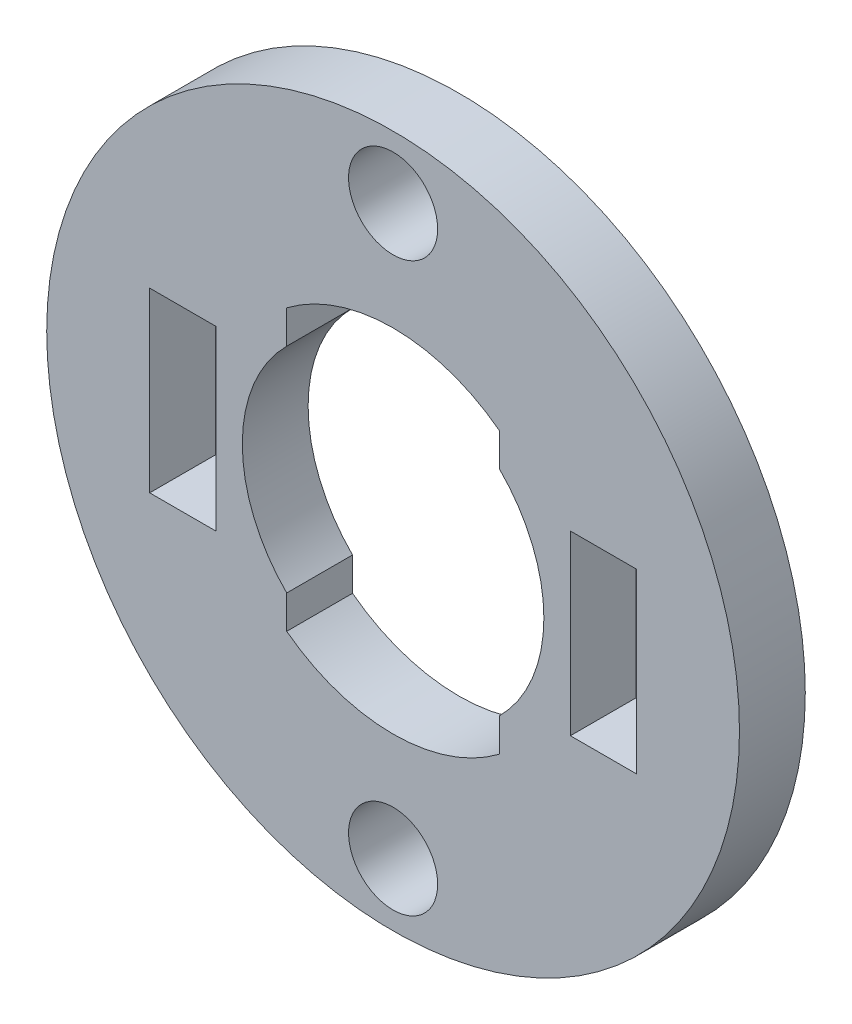
ISO-10303-21;
HEADER;
FILE_DESCRIPTION(('STEP AP214'),'2;1');
FILE_NAME('part.step','',(''),(''),'','','');
FILE_SCHEMA(('AUTOMOTIVE_DESIGN { 1 0 10303 214 1 1 1 1 }'));
ENDSEC;
DATA;
#1=APPLICATION_CONTEXT('core data for automotive mechanical design processes');
#2=APPLICATION_PROTOCOL_DEFINITION('international standard','automotive_design',2000,#1);
#3=PRODUCT_CONTEXT('',#1,'mechanical');
#4=PRODUCT('Part','Part','',(#3));
#5=PRODUCT_RELATED_PRODUCT_CATEGORY('part','',(#4));
#6=PRODUCT_DEFINITION_FORMATION('','',#4);
#7=PRODUCT_DEFINITION_CONTEXT('part definition',#1,'design');
#8=PRODUCT_DEFINITION('design','',#6,#7);
#9=PRODUCT_DEFINITION_SHAPE('','',#8);
#10=(LENGTH_UNIT() NAMED_UNIT(*) SI_UNIT(.MILLI.,.METRE.));
#11=(NAMED_UNIT(*) PLANE_ANGLE_UNIT() SI_UNIT($,.RADIAN.));
#12=(NAMED_UNIT(*) SI_UNIT($,.STERADIAN.) SOLID_ANGLE_UNIT());
#13=UNCERTAINTY_MEASURE_WITH_UNIT(LENGTH_MEASURE(1.E-05),#10,'distance_accuracy_value','');
#14=(GEOMETRIC_REPRESENTATION_CONTEXT(3) GLOBAL_UNCERTAINTY_ASSIGNED_CONTEXT((#13)) GLOBAL_UNIT_ASSIGNED_CONTEXT((#10,
#11,#12)) REPRESENTATION_CONTEXT('',''));
#15=CARTESIAN_POINT('',(0.,0.,0.));
#16=DIRECTION('',(0.,0.,1.));
#17=DIRECTION('',(1.,0.,0.));
#18=AXIS2_PLACEMENT_3D('',#15,#16,#17);
#19=CARTESIAN_POINT('',(0.,0.,2.9464));
#20=DIRECTION('',(0.,0.,1.));
#21=DIRECTION('',(1.,0.,0.));
#22=AXIS2_PLACEMENT_3D('',#19,#20,#21);
#23=PLANE('',#22);
#24=CARTESIAN_POINT('',(0.,12.7,2.9464));
#25=DIRECTION('',(0.,0.,1.));
#26=DIRECTION('',(1.,0.,0.));
#27=AXIS2_PLACEMENT_3D('',#24,#25,#26);
#28=CIRCLE('',#27,1.9939);
#29=CARTESIAN_POINT('',(1.9939,12.7,2.9464));
#30=VERTEX_POINT('',#29);
#31=EDGE_CURVE('E308',#30,#30,#28,.T.);
#32=ORIENTED_EDGE('',*,*,#31,.F.);
#33=EDGE_LOOP('',(#32));
#34=FACE_BOUND('',#33,.T.);
#35=CARTESIAN_POINT('',(0.,-12.7,2.9464));
#36=DIRECTION('',(0.,0.,1.));
#37=DIRECTION('',(1.,0.,0.));
#38=AXIS2_PLACEMENT_3D('',#35,#36,#37);
#39=CIRCLE('',#38,1.9939);
#40=CARTESIAN_POINT('',(1.9939,-12.7,2.9464));
#41=VERTEX_POINT('',#40);
#42=EDGE_CURVE('E300',#41,#41,#39,.T.);
#43=ORIENTED_EDGE('',*,*,#42,.F.);
#44=EDGE_LOOP('',(#43));
#45=FACE_BOUND('',#44,.T.);
#46=CARTESIAN_POINT('',(0.,0.,2.9464));
#47=DIRECTION('',(0.,0.,1.));
#48=DIRECTION('',(1.,0.,0.));
#49=AXIS2_PLACEMENT_3D('',#46,#47,#48);
#50=CIRCLE('',#49,15.5067);
#51=CARTESIAN_POINT('',(15.5067,0.,2.9464));
#52=VERTEX_POINT('',#51);
#53=EDGE_CURVE('E11',#52,#52,#50,.T.);
#54=ORIENTED_EDGE('',*,*,#53,.T.);
#55=EDGE_LOOP('',(#54));
#56=FACE_BOUND('',#55,.T.);
#57=CARTESIAN_POINT('',(0.,0.,2.9464));
#58=DIRECTION('',(0.,0.,1.));
#59=DIRECTION('',(1.,0.,0.));
#60=AXIS2_PLACEMENT_3D('',#57,#58,#59);
#61=CIRCLE('',#60,7.874);
#62=CARTESIAN_POINT('',(4.76249999999999,6.27044414296149,2.9464));
#63=VERTEX_POINT('',#62);
#64=CARTESIAN_POINT('',(-4.76250000000001,6.27044414296148,2.9464));
#65=VERTEX_POINT('',#64);
#66=EDGE_CURVE('E232',#63,#65,#61,.T.);
#67=ORIENTED_EDGE('',*,*,#66,.F.);
#68=DIRECTION('',(0.,1.,0.));
#69=VECTOR('',#68,1.);
#70=CARTESIAN_POINT('',(4.76249999999999,6.27044414296149,2.9464));
#71=LINE('',#70,#69);
#72=CARTESIAN_POINT('',(4.76250000000001,4.78341862583654,2.9464));
#73=VERTEX_POINT('',#72);
#74=EDGE_CURVE('E252',#73,#63,#71,.T.);
#75=ORIENTED_EDGE('',*,*,#74,.F.);
#76=CARTESIAN_POINT('',(0.,0.,2.9464));
#77=DIRECTION('',(0.,0.,1.));
#78=DIRECTION('',(1.,0.,0.));
#79=AXIS2_PLACEMENT_3D('',#76,#77,#78);
#80=CIRCLE('',#79,6.75);
#81=CARTESIAN_POINT('',(4.76250000000001,-4.78341862583654,2.9464));
#82=VERTEX_POINT('',#81);
#83=EDGE_CURVE('E249',#82,#73,#80,.T.);
#84=ORIENTED_EDGE('',*,*,#83,.F.);
#85=DIRECTION('',(0.,1.,0.));
#86=VECTOR('',#85,1.);
#87=CARTESIAN_POINT('',(4.76249999999999,-6.27044414296149,2.9464));
#88=LINE('',#87,#86);
#89=CARTESIAN_POINT('',(4.76249999999999,-6.27044414296149,2.9464));
#90=VERTEX_POINT('',#89);
#91=EDGE_CURVE('E246',#90,#82,#88,.T.);
#92=ORIENTED_EDGE('',*,*,#91,.F.);
#93=CARTESIAN_POINT('',(0.,0.,2.9464));
#94=DIRECTION('',(0.,0.,1.));
#95=DIRECTION('',(-1.,0.,0.));
#96=AXIS2_PLACEMENT_3D('',#93,#94,#95);
#97=CIRCLE('',#96,7.874);
#98=CARTESIAN_POINT('',(-4.76250000000002,-6.27044414296147,2.9464));
#99=VERTEX_POINT('',#98);
#100=EDGE_CURVE('E243',#99,#90,#97,.T.);
#101=ORIENTED_EDGE('',*,*,#100,.F.);
#102=DIRECTION('',(0.,-1.,0.));
#103=VECTOR('',#102,1.);
#104=CARTESIAN_POINT('',(-4.76250000000001,-6.27044414296148,2.9464));
#105=LINE('',#104,#103);
#106=CARTESIAN_POINT('',(-4.76249999999999,-4.78341862583655,2.9464));
#107=VERTEX_POINT('',#106);
#108=EDGE_CURVE('E240',#107,#99,#105,.T.);
#109=ORIENTED_EDGE('',*,*,#108,.F.);
#110=CARTESIAN_POINT('',(0.,0.,2.9464));
#111=DIRECTION('',(0.,0.,1.));
#112=DIRECTION('',(1.,0.,0.));
#113=AXIS2_PLACEMENT_3D('',#110,#111,#112);
#114=CIRCLE('',#113,6.75);
#115=CARTESIAN_POINT('',(-4.76249999999999,4.78341862583655,2.9464));
#116=VERTEX_POINT('',#115);
#117=EDGE_CURVE('E237',#116,#107,#114,.T.);
#118=ORIENTED_EDGE('',*,*,#117,.F.);
#119=DIRECTION('',(0.,-1.,0.));
#120=VECTOR('',#119,1.);
#121=CARTESIAN_POINT('',(-4.76250000000001,6.27044414296148,2.9464));
#122=LINE('',#121,#120);
#123=EDGE_CURVE('E234',#65,#116,#122,.T.);
#124=ORIENTED_EDGE('',*,*,#123,.F.);
#125=EDGE_LOOP('',(#67,#75,#84,#92,#101,#109,#118,#124));
#126=FACE_BOUND('',#125,.T.);
#127=DIRECTION('',(0.,1.,0.));
#128=VECTOR('',#127,1.);
#129=CARTESIAN_POINT('',(7.9375,3.96875,2.9464));
#130=LINE('',#129,#128);
#131=CARTESIAN_POINT('',(7.9375,-3.96875,2.9464));
#132=VERTEX_POINT('',#131);
#133=CARTESIAN_POINT('',(7.9375,3.96875,2.9464));
#134=VERTEX_POINT('',#133);
#135=EDGE_CURVE('E186',#132,#134,#130,.T.);
#136=ORIENTED_EDGE('',*,*,#135,.T.);
#137=DIRECTION('',(1.,0.,0.));
#138=VECTOR('',#137,1.);
#139=CARTESIAN_POINT('',(10.8966,3.96875,2.9464));
#140=LINE('',#139,#138);
#141=CARTESIAN_POINT('',(10.8966,3.96875,2.9464));
#142=VERTEX_POINT('',#141);
#143=EDGE_CURVE('E203',#134,#142,#140,.T.);
#144=ORIENTED_EDGE('',*,*,#143,.T.);
#145=DIRECTION('',(0.,-1.,0.));
#146=VECTOR('',#145,1.);
#147=CARTESIAN_POINT('',(10.8966,3.96875,2.9464));
#148=LINE('',#147,#146);
#149=CARTESIAN_POINT('',(10.8966,-3.96875,2.9464));
#150=VERTEX_POINT('',#149);
#151=EDGE_CURVE('E160',#142,#150,#148,.T.);
#152=ORIENTED_EDGE('',*,*,#151,.T.);
#153=DIRECTION('',(-1.,0.,0.));
#154=VECTOR('',#153,1.);
#155=CARTESIAN_POINT('',(10.8966,-3.96875,2.9464));
#156=LINE('',#155,#154);
#157=EDGE_CURVE('E183',#150,#132,#156,.T.);
#158=ORIENTED_EDGE('',*,*,#157,.T.);
#159=EDGE_LOOP('',(#136,#144,#152,#158));
#160=FACE_BOUND('',#159,.T.);
#161=DIRECTION('',(-1.,0.,0.));
#162=VECTOR('',#161,1.);
#163=CARTESIAN_POINT('',(-10.8966,3.96875,2.9464));
#164=LINE('',#163,#162);
#165=CARTESIAN_POINT('',(-7.9375,3.96875,2.9464));
#166=VERTEX_POINT('',#165);
#167=CARTESIAN_POINT('',(-10.8966,3.96875,2.9464));
#168=VERTEX_POINT('',#167);
#169=EDGE_CURVE('E164',#166,#168,#164,.T.);
#170=ORIENTED_EDGE('',*,*,#169,.F.);
#171=DIRECTION('',(0.,1.,0.));
#172=VECTOR('',#171,1.);
#173=CARTESIAN_POINT('',(-7.9375,3.96875,2.9464));
#174=LINE('',#173,#172);
#175=CARTESIAN_POINT('',(-7.9375,-3.96875,2.9464));
#176=VERTEX_POINT('',#175);
#177=EDGE_CURVE('E148',#176,#166,#174,.T.);
#178=ORIENTED_EDGE('',*,*,#177,.F.);
#179=DIRECTION('',(1.,0.,0.));
#180=VECTOR('',#179,1.);
#181=CARTESIAN_POINT('',(-10.8966,-3.96875,2.9464));
#182=LINE('',#181,#180);
#183=CARTESIAN_POINT('',(-10.8966,-3.96875,2.9464));
#184=VERTEX_POINT('',#183);
#185=EDGE_CURVE('E157',#184,#176,#182,.T.);
#186=ORIENTED_EDGE('',*,*,#185,.F.);
#187=DIRECTION('',(0.,-1.,0.));
#188=VECTOR('',#187,1.);
#189=CARTESIAN_POINT('',(-10.8966,3.96875,2.9464));
#190=LINE('',#189,#188);
#191=EDGE_CURVE('E48',#168,#184,#190,.T.);
#192=ORIENTED_EDGE('',*,*,#191,.F.);
#193=EDGE_LOOP('',(#170,#178,#186,#192));
#194=FACE_BOUND('',#193,.T.);
#195=ADVANCED_FACE('F33',(#34,#45,#56,#126,#160,#194),#23,.T.);
#196=CARTESIAN_POINT('',(0.,0.,0.));
#197=DIRECTION('',(0.,0.,1.));
#198=DIRECTION('',(1.,0.,0.));
#199=AXIS2_PLACEMENT_3D('',#196,#197,#198);
#200=PLANE('',#199);
#201=CARTESIAN_POINT('',(0.,12.7,0.));
#202=DIRECTION('',(0.,0.,1.));
#203=DIRECTION('',(1.,0.,0.));
#204=AXIS2_PLACEMENT_3D('',#201,#202,#203);
#205=CIRCLE('',#204,1.9939);
#206=CARTESIAN_POINT('',(1.9939,12.7,0.));
#207=VERTEX_POINT('',#206);
#208=EDGE_CURVE('E305',#207,#207,#205,.T.);
#209=ORIENTED_EDGE('',*,*,#208,.T.);
#210=EDGE_LOOP('',(#209));
#211=FACE_BOUND('',#210,.T.);
#212=CARTESIAN_POINT('',(0.,-12.7,0.));
#213=DIRECTION('',(0.,0.,1.));
#214=DIRECTION('',(1.,0.,0.));
#215=AXIS2_PLACEMENT_3D('',#212,#213,#214);
#216=CIRCLE('',#215,1.9939);
#217=CARTESIAN_POINT('',(1.9939,-12.7,0.));
#218=VERTEX_POINT('',#217);
#219=EDGE_CURVE('E298',#218,#218,#216,.T.);
#220=ORIENTED_EDGE('',*,*,#219,.T.);
#221=EDGE_LOOP('',(#220));
#222=FACE_BOUND('',#221,.T.);
#223=CARTESIAN_POINT('',(0.,0.,0.));
#224=DIRECTION('',(0.,0.,1.));
#225=DIRECTION('',(1.,0.,0.));
#226=AXIS2_PLACEMENT_3D('',#223,#224,#225);
#227=CIRCLE('',#226,15.5067);
#228=CARTESIAN_POINT('',(15.5067,0.,0.));
#229=VERTEX_POINT('',#228);
#230=EDGE_CURVE('E37',#229,#229,#227,.T.);
#231=ORIENTED_EDGE('',*,*,#230,.F.);
#232=EDGE_LOOP('',(#231));
#233=FACE_BOUND('',#232,.T.);
#234=DIRECTION('',(0.,-1.,0.));
#235=VECTOR('',#234,1.);
#236=CARTESIAN_POINT('',(4.76249999999999,6.27044414296149,0.));
#237=LINE('',#236,#235);
#238=CARTESIAN_POINT('',(4.76249999999999,6.27044414296149,0.));
#239=VERTEX_POINT('',#238);
#240=CARTESIAN_POINT('',(4.76250000000001,4.78341862583654,0.));
#241=VERTEX_POINT('',#240);
#242=EDGE_CURVE('E226',#239,#241,#237,.T.);
#243=ORIENTED_EDGE('',*,*,#242,.F.);
#244=CARTESIAN_POINT('',(0.,0.,0.));
#245=DIRECTION('',(0.,0.,1.));
#246=DIRECTION('',(1.,0.,0.));
#247=AXIS2_PLACEMENT_3D('',#244,#245,#246);
#248=CIRCLE('',#247,7.874);
#249=CARTESIAN_POINT('',(-4.76250000000001,6.27044414296148,0.));
#250=VERTEX_POINT('',#249);
#251=EDGE_CURVE('E229',#250,#239,#248,.F.);
#252=ORIENTED_EDGE('',*,*,#251,.F.);
#253=DIRECTION('',(0.,1.,0.));
#254=VECTOR('',#253,1.);
#255=CARTESIAN_POINT('',(-4.76250000000001,6.27044414296148,0.));
#256=LINE('',#255,#254);
#257=CARTESIAN_POINT('',(-4.76249999999999,4.78341862583655,0.));
#258=VERTEX_POINT('',#257);
#259=EDGE_CURVE('E258',#258,#250,#256,.T.);
#260=ORIENTED_EDGE('',*,*,#259,.F.);
#261=CARTESIAN_POINT('',(0.,0.,0.));
#262=DIRECTION('',(0.,0.,1.));
#263=DIRECTION('',(1.,0.,0.));
#264=AXIS2_PLACEMENT_3D('',#261,#262,#263);
#265=CIRCLE('',#264,6.75);
#266=CARTESIAN_POINT('',(-4.76249999999999,-4.78341862583655,0.));
#267=VERTEX_POINT('',#266);
#268=EDGE_CURVE('E212',#267,#258,#265,.F.);
#269=ORIENTED_EDGE('',*,*,#268,.F.);
#270=DIRECTION('',(0.,1.,0.));
#271=VECTOR('',#270,1.);
#272=CARTESIAN_POINT('',(-4.76250000000001,-6.27044414296148,0.));
#273=LINE('',#272,#271);
#274=CARTESIAN_POINT('',(-4.76250000000002,-6.27044414296147,0.));
#275=VERTEX_POINT('',#274);
#276=EDGE_CURVE('E214',#275,#267,#273,.T.);
#277=ORIENTED_EDGE('',*,*,#276,.F.);
#278=CARTESIAN_POINT('',(0.,0.,0.));
#279=DIRECTION('',(0.,0.,1.));
#280=DIRECTION('',(1.,0.,0.));
#281=AXIS2_PLACEMENT_3D('',#278,#279,#280);
#282=CIRCLE('',#281,7.874);
#283=CARTESIAN_POINT('',(4.76249999999999,-6.27044414296149,0.));
#284=VERTEX_POINT('',#283);
#285=EDGE_CURVE('E217',#284,#275,#282,.F.);
#286=ORIENTED_EDGE('',*,*,#285,.F.);
#287=DIRECTION('',(0.,-1.,0.));
#288=VECTOR('',#287,1.);
#289=CARTESIAN_POINT('',(4.76249999999999,-6.27044414296149,0.));
#290=LINE('',#289,#288);
#291=CARTESIAN_POINT('',(4.76250000000001,-4.78341862583654,0.));
#292=VERTEX_POINT('',#291);
#293=EDGE_CURVE('E220',#292,#284,#290,.T.);
#294=ORIENTED_EDGE('',*,*,#293,.F.);
#295=CARTESIAN_POINT('',(0.,0.,0.));
#296=DIRECTION('',(0.,0.,1.));
#297=DIRECTION('',(1.,0.,0.));
#298=AXIS2_PLACEMENT_3D('',#295,#296,#297);
#299=CIRCLE('',#298,6.75);
#300=EDGE_CURVE('E223',#241,#292,#299,.F.);
#301=ORIENTED_EDGE('',*,*,#300,.F.);
#302=EDGE_LOOP('',(#243,#252,#260,#269,#277,#286,#294,#301));
#303=FACE_BOUND('',#302,.T.);
#304=DIRECTION('',(1.,0.,0.));
#305=VECTOR('',#304,1.);
#306=CARTESIAN_POINT('',(10.8966,3.96875,0.));
#307=LINE('',#306,#305);
#308=CARTESIAN_POINT('',(7.9375,3.96875,0.));
#309=VERTEX_POINT('',#308);
#310=CARTESIAN_POINT('',(10.8966,3.96875,0.));
#311=VERTEX_POINT('',#310);
#312=EDGE_CURVE('E191',#309,#311,#307,.T.);
#313=ORIENTED_EDGE('',*,*,#312,.F.);
#314=DIRECTION('',(0.,1.,0.));
#315=VECTOR('',#314,1.);
#316=CARTESIAN_POINT('',(7.9375,3.96875,0.));
#317=LINE('',#316,#315);
#318=CARTESIAN_POINT('',(7.9375,-3.96875,0.));
#319=VERTEX_POINT('',#318);
#320=EDGE_CURVE('E189',#319,#309,#317,.T.);
#321=ORIENTED_EDGE('',*,*,#320,.F.);
#322=DIRECTION('',(-1.,0.,0.));
#323=VECTOR('',#322,1.);
#324=CARTESIAN_POINT('',(10.8966,-3.96875,0.));
#325=LINE('',#324,#323);
#326=CARTESIAN_POINT('',(10.8966,-3.96875,0.));
#327=VERTEX_POINT('',#326);
#328=EDGE_CURVE('E197',#327,#319,#325,.T.);
#329=ORIENTED_EDGE('',*,*,#328,.F.);
#330=DIRECTION('',(0.,-1.,0.));
#331=VECTOR('',#330,1.);
#332=CARTESIAN_POINT('',(10.8966,3.96875,0.));
#333=LINE('',#332,#331);
#334=EDGE_CURVE('E194',#311,#327,#333,.T.);
#335=ORIENTED_EDGE('',*,*,#334,.F.);
#336=EDGE_LOOP('',(#313,#321,#329,#335));
#337=FACE_BOUND('',#336,.T.);
#338=DIRECTION('',(0.,1.,0.));
#339=VECTOR('',#338,1.);
#340=CARTESIAN_POINT('',(-7.9375,3.96875,0.));
#341=LINE('',#340,#339);
#342=CARTESIAN_POINT('',(-7.9375,-3.96875,0.));
#343=VERTEX_POINT('',#342);
#344=CARTESIAN_POINT('',(-7.9375,3.96875,0.));
#345=VERTEX_POINT('',#344);
#346=EDGE_CURVE('E56',#343,#345,#341,.T.);
#347=ORIENTED_EDGE('',*,*,#346,.T.);
#348=DIRECTION('',(-1.,0.,0.));
#349=VECTOR('',#348,1.);
#350=CARTESIAN_POINT('',(-10.8966,3.96875,0.));
#351=LINE('',#350,#349);
#352=CARTESIAN_POINT('',(-10.8966,3.96875,0.));
#353=VERTEX_POINT('',#352);
#354=EDGE_CURVE('E154',#345,#353,#351,.T.);
#355=ORIENTED_EDGE('',*,*,#354,.T.);
#356=DIRECTION('',(0.,-1.,0.));
#357=VECTOR('',#356,1.);
#358=CARTESIAN_POINT('',(-10.8966,3.96875,0.));
#359=LINE('',#358,#357);
#360=CARTESIAN_POINT('',(-10.8966,-3.96875,0.));
#361=VERTEX_POINT('',#360);
#362=EDGE_CURVE('E172',#353,#361,#359,.T.);
#363=ORIENTED_EDGE('',*,*,#362,.T.);
#364=DIRECTION('',(1.,0.,0.));
#365=VECTOR('',#364,1.);
#366=CARTESIAN_POINT('',(-10.8966,-3.96875,0.));
#367=LINE('',#366,#365);
#368=EDGE_CURVE('E166',#361,#343,#367,.T.);
#369=ORIENTED_EDGE('',*,*,#368,.T.);
#370=EDGE_LOOP('',(#347,#355,#363,#369));
#371=FACE_BOUND('',#370,.T.);
#372=ADVANCED_FACE('F282',(#211,#222,#233,#303,#337,#371),#200,.F.);
#373=CARTESIAN_POINT('',(0.,0.,2.9464));
#374=DIRECTION('',(0.,0.,-1.));
#375=DIRECTION('',(-1.,0.,0.));
#376=AXIS2_PLACEMENT_3D('',#373,#374,#375);
#377=CYLINDRICAL_SURFACE('',#376,15.5067);
#378=ORIENTED_EDGE('',*,*,#53,.F.);
#379=EDGE_LOOP('',(#378));
#380=FACE_BOUND('',#379,.T.);
#381=ORIENTED_EDGE('',*,*,#230,.T.);
#382=EDGE_LOOP('',(#381));
#383=FACE_BOUND('',#382,.T.);
#384=ADVANCED_FACE('F35',(#380,#383),#377,.T.);
#385=CARTESIAN_POINT('',(0.,0.,-0.00100000000000013));
#386=DIRECTION('',(0.,0.,1.));
#387=DIRECTION('',(1.,0.,0.));
#388=AXIS2_PLACEMENT_3D('',#385,#386,#387);
#389=CYLINDRICAL_SURFACE('',#388,7.874);
#390=ORIENTED_EDGE('',*,*,#251,.T.);
#391=DIRECTION('',(0.,0.,1.));
#392=VECTOR('',#391,1.);
#393=CARTESIAN_POINT('',(4.76249999999999,6.27044414296149,-0.00100000000000013));
#394=LINE('',#393,#392);
#395=EDGE_CURVE('E256',#239,#63,#394,.T.);
#396=ORIENTED_EDGE('',*,*,#395,.T.);
#397=ORIENTED_EDGE('',*,*,#66,.T.);
#398=DIRECTION('',(0.,0.,1.));
#399=VECTOR('',#398,1.);
#400=CARTESIAN_POINT('',(-4.76250000000001,6.27044414296148,-0.00100000000000013));
#401=LINE('',#400,#399);
#402=EDGE_CURVE('E255',#250,#65,#401,.T.);
#403=ORIENTED_EDGE('',*,*,#402,.F.);
#404=EDGE_LOOP('',(#390,#396,#397,#403));
#405=FACE_BOUND('',#404,.T.);
#406=ADVANCED_FACE('F355',(#405),#389,.F.);
#407=CARTESIAN_POINT('',(4.76249999999999,6.27044414296149,-0.00100000000000013));
#408=DIRECTION('',(1.,0.,0.));
#409=DIRECTION('',(0.,1.,0.));
#410=AXIS2_PLACEMENT_3D('',#407,#408,#409);
#411=PLANE('',#410);
#412=ORIENTED_EDGE('',*,*,#242,.T.);
#413=DIRECTION('',(0.,0.,1.));
#414=VECTOR('',#413,1.);
#415=CARTESIAN_POINT('',(4.76250000000001,4.78341862583654,-0.00100000000000013));
#416=LINE('',#415,#414);
#417=EDGE_CURVE('E259',#241,#73,#416,.T.);
#418=ORIENTED_EDGE('',*,*,#417,.T.);
#419=ORIENTED_EDGE('',*,*,#74,.T.);
#420=ORIENTED_EDGE('',*,*,#395,.F.);
#421=EDGE_LOOP('',(#412,#418,#419,#420));
#422=FACE_BOUND('',#421,.T.);
#423=ADVANCED_FACE('F351',(#422),#411,.F.);
#424=CARTESIAN_POINT('',(0.,0.,-0.00100000000000013));
#425=DIRECTION('',(0.,0.,1.));
#426=DIRECTION('',(1.,0.,0.));
#427=AXIS2_PLACEMENT_3D('',#424,#425,#426);
#428=CYLINDRICAL_SURFACE('',#427,6.75);
#429=ORIENTED_EDGE('',*,*,#300,.T.);
#430=DIRECTION('',(0.,0.,1.));
#431=VECTOR('',#430,1.);
#432=CARTESIAN_POINT('',(4.76250000000001,-4.78341862583654,-0.00100000000000013));
#433=LINE('',#432,#431);
#434=EDGE_CURVE('E261',#292,#82,#433,.T.);
#435=ORIENTED_EDGE('',*,*,#434,.T.);
#436=ORIENTED_EDGE('',*,*,#83,.T.);
#437=ORIENTED_EDGE('',*,*,#417,.F.);
#438=EDGE_LOOP('',(#429,#435,#436,#437));
#439=FACE_BOUND('',#438,.T.);
#440=ADVANCED_FACE('F354',(#439),#428,.F.);
#441=CARTESIAN_POINT('',(4.76249999999999,-6.27044414296149,-0.00100000000000013));
#442=DIRECTION('',(1.,0.,0.));
#443=DIRECTION('',(0.,1.,0.));
#444=AXIS2_PLACEMENT_3D('',#441,#442,#443);
#445=PLANE('',#444);
#446=ORIENTED_EDGE('',*,*,#293,.T.);
#447=DIRECTION('',(0.,0.,1.));
#448=VECTOR('',#447,1.);
#449=CARTESIAN_POINT('',(4.76249999999999,-6.27044414296149,-0.00100000000000013));
#450=LINE('',#449,#448);
#451=EDGE_CURVE('E263',#284,#90,#450,.T.);
#452=ORIENTED_EDGE('',*,*,#451,.T.);
#453=ORIENTED_EDGE('',*,*,#91,.T.);
#454=ORIENTED_EDGE('',*,*,#434,.F.);
#455=EDGE_LOOP('',(#446,#452,#453,#454));
#456=FACE_BOUND('',#455,.T.);
#457=ADVANCED_FACE('F359',(#456),#445,.F.);
#458=CARTESIAN_POINT('',(0.,0.,-0.00100000000000013));
#459=DIRECTION('',(0.,0.,1.));
#460=DIRECTION('',(1.,0.,0.));
#461=AXIS2_PLACEMENT_3D('',#458,#459,#460);
#462=CYLINDRICAL_SURFACE('',#461,7.874);
#463=ORIENTED_EDGE('',*,*,#285,.T.);
#464=DIRECTION('',(0.,0.,1.));
#465=VECTOR('',#464,1.);
#466=CARTESIAN_POINT('',(-4.76250000000002,-6.27044414296147,-0.00100000000000013));
#467=LINE('',#466,#465);
#468=EDGE_CURVE('E265',#275,#99,#467,.T.);
#469=ORIENTED_EDGE('',*,*,#468,.T.);
#470=ORIENTED_EDGE('',*,*,#100,.T.);
#471=ORIENTED_EDGE('',*,*,#451,.F.);
#472=EDGE_LOOP('',(#463,#469,#470,#471));
#473=FACE_BOUND('',#472,.T.);
#474=ADVANCED_FACE('F363',(#473),#462,.F.);
#475=CARTESIAN_POINT('',(-4.76250000000001,-6.27044414296148,-0.00100000000000013));
#476=DIRECTION('',(-1.,0.,0.));
#477=DIRECTION('',(0.,-1.,0.));
#478=AXIS2_PLACEMENT_3D('',#475,#476,#477);
#479=PLANE('',#478);
#480=ORIENTED_EDGE('',*,*,#276,.T.);
#481=DIRECTION('',(0.,0.,1.));
#482=VECTOR('',#481,1.);
#483=CARTESIAN_POINT('',(-4.76249999999999,-4.78341862583655,-0.00100000000000013));
#484=LINE('',#483,#482);
#485=EDGE_CURVE('E267',#267,#107,#484,.T.);
#486=ORIENTED_EDGE('',*,*,#485,.T.);
#487=ORIENTED_EDGE('',*,*,#108,.T.);
#488=ORIENTED_EDGE('',*,*,#468,.F.);
#489=EDGE_LOOP('',(#480,#486,#487,#488));
#490=FACE_BOUND('',#489,.T.);
#491=ADVANCED_FACE('F367',(#490),#479,.F.);
#492=CARTESIAN_POINT('',(0.,0.,-0.00100000000000013));
#493=DIRECTION('',(0.,0.,1.));
#494=DIRECTION('',(1.,0.,0.));
#495=AXIS2_PLACEMENT_3D('',#492,#493,#494);
#496=CYLINDRICAL_SURFACE('',#495,6.75);
#497=ORIENTED_EDGE('',*,*,#268,.T.);
#498=DIRECTION('',(0.,0.,1.));
#499=VECTOR('',#498,1.);
#500=CARTESIAN_POINT('',(-4.76249999999999,4.78341862583655,-0.00100000000000013));
#501=LINE('',#500,#499);
#502=EDGE_CURVE('E269',#258,#116,#501,.T.);
#503=ORIENTED_EDGE('',*,*,#502,.T.);
#504=ORIENTED_EDGE('',*,*,#117,.T.);
#505=ORIENTED_EDGE('',*,*,#485,.F.);
#506=EDGE_LOOP('',(#497,#503,#504,#505));
#507=FACE_BOUND('',#506,.T.);
#508=ADVANCED_FACE('F371',(#507),#496,.F.);
#509=CARTESIAN_POINT('',(-4.76250000000001,6.27044414296148,-0.00100000000000013));
#510=DIRECTION('',(-1.,0.,0.));
#511=DIRECTION('',(0.,-1.,0.));
#512=AXIS2_PLACEMENT_3D('',#509,#510,#511);
#513=PLANE('',#512);
#514=ORIENTED_EDGE('',*,*,#259,.T.);
#515=ORIENTED_EDGE('',*,*,#402,.T.);
#516=ORIENTED_EDGE('',*,*,#123,.T.);
#517=ORIENTED_EDGE('',*,*,#502,.F.);
#518=EDGE_LOOP('',(#514,#515,#516,#517));
#519=FACE_BOUND('',#518,.T.);
#520=ADVANCED_FACE('F350',(#519),#513,.F.);
#521=CARTESIAN_POINT('',(7.9375,3.96875,2.9474));
#522=DIRECTION('',(-1.,0.,0.));
#523=DIRECTION('',(0.,0.,1.));
#524=AXIS2_PLACEMENT_3D('',#521,#522,#523);
#525=PLANE('',#524);
#526=DIRECTION('',(0.,0.,-1.));
#527=VECTOR('',#526,1.);
#528=CARTESIAN_POINT('',(7.9375,-3.96875,2.9474));
#529=LINE('',#528,#527);
#530=EDGE_CURVE('E201',#132,#319,#529,.T.);
#531=ORIENTED_EDGE('',*,*,#530,.T.);
#532=ORIENTED_EDGE('',*,*,#320,.T.);
#533=DIRECTION('',(0.,0.,-1.));
#534=VECTOR('',#533,1.);
#535=CARTESIAN_POINT('',(7.9375,3.96875,2.9474));
#536=LINE('',#535,#534);
#537=EDGE_CURVE('E200',#134,#309,#536,.T.);
#538=ORIENTED_EDGE('',*,*,#537,.F.);
#539=ORIENTED_EDGE('',*,*,#135,.F.);
#540=EDGE_LOOP('',(#531,#532,#538,#539));
#541=FACE_BOUND('',#540,.T.);
#542=ADVANCED_FACE('F328',(#541),#525,.F.);
#543=CARTESIAN_POINT('',(10.8966,-3.96875,2.9474));
#544=DIRECTION('',(0.,-1.,0.));
#545=DIRECTION('',(0.,0.,-1.));
#546=AXIS2_PLACEMENT_3D('',#543,#544,#545);
#547=PLANE('',#546);
#548=DIRECTION('',(0.,0.,-1.));
#549=VECTOR('',#548,1.);
#550=CARTESIAN_POINT('',(10.8966,-3.96875,2.9474));
#551=LINE('',#550,#549);
#552=EDGE_CURVE('E204',#150,#327,#551,.T.);
#553=ORIENTED_EDGE('',*,*,#552,.T.);
#554=ORIENTED_EDGE('',*,*,#328,.T.);
#555=ORIENTED_EDGE('',*,*,#530,.F.);
#556=ORIENTED_EDGE('',*,*,#157,.F.);
#557=EDGE_LOOP('',(#553,#554,#555,#556));
#558=FACE_BOUND('',#557,.T.);
#559=ADVANCED_FACE('F330',(#558),#547,.F.);
#560=CARTESIAN_POINT('',(10.8966,3.96875,2.9474));
#561=DIRECTION('',(1.,0.,0.));
#562=DIRECTION('',(0.,1.,0.));
#563=AXIS2_PLACEMENT_3D('',#560,#561,#562);
#564=PLANE('',#563);
#565=DIRECTION('',(0.,0.,-1.));
#566=VECTOR('',#565,1.);
#567=CARTESIAN_POINT('',(10.8966,3.96875,2.9474));
#568=LINE('',#567,#566);
#569=EDGE_CURVE('E206',#142,#311,#568,.T.);
#570=ORIENTED_EDGE('',*,*,#569,.T.);
#571=ORIENTED_EDGE('',*,*,#334,.T.);
#572=ORIENTED_EDGE('',*,*,#552,.F.);
#573=ORIENTED_EDGE('',*,*,#151,.F.);
#574=EDGE_LOOP('',(#570,#571,#572,#573));
#575=FACE_BOUND('',#574,.T.);
#576=ADVANCED_FACE('F337',(#575),#564,.F.);
#577=CARTESIAN_POINT('',(10.8966,3.96875,2.9474));
#578=DIRECTION('',(0.,1.,0.));
#579=DIRECTION('',(0.,0.,1.));
#580=AXIS2_PLACEMENT_3D('',#577,#578,#579);
#581=PLANE('',#580);
#582=ORIENTED_EDGE('',*,*,#537,.T.);
#583=ORIENTED_EDGE('',*,*,#312,.T.);
#584=ORIENTED_EDGE('',*,*,#569,.F.);
#585=ORIENTED_EDGE('',*,*,#143,.F.);
#586=EDGE_LOOP('',(#582,#583,#584,#585));
#587=FACE_BOUND('',#586,.T.);
#588=ADVANCED_FACE('F334',(#587),#581,.F.);
#589=CARTESIAN_POINT('',(-7.9375,3.96875,2.9474));
#590=DIRECTION('',(-1.,0.,0.));
#591=DIRECTION('',(0.,0.,1.));
#592=AXIS2_PLACEMENT_3D('',#589,#590,#591);
#593=PLANE('',#592);
#594=ORIENTED_EDGE('',*,*,#177,.T.);
#595=DIRECTION('',(0.,0.,-1.));
#596=VECTOR('',#595,1.);
#597=CARTESIAN_POINT('',(-7.9375,3.96875,2.9474));
#598=LINE('',#597,#596);
#599=EDGE_CURVE('E161',#166,#345,#598,.T.);
#600=ORIENTED_EDGE('',*,*,#599,.T.);
#601=ORIENTED_EDGE('',*,*,#346,.F.);
#602=DIRECTION('',(0.,0.,-1.));
#603=VECTOR('',#602,1.);
#604=CARTESIAN_POINT('',(-7.9375,-3.96875,2.9474));
#605=LINE('',#604,#603);
#606=EDGE_CURVE('E144',#176,#343,#605,.T.);
#607=ORIENTED_EDGE('',*,*,#606,.F.);
#608=EDGE_LOOP('',(#594,#600,#601,#607));
#609=FACE_BOUND('',#608,.T.);
#610=ADVANCED_FACE('F146',(#609),#593,.T.);
#611=CARTESIAN_POINT('',(-10.8966,3.96875,2.9474));
#612=DIRECTION('',(0.,-1.,0.));
#613=DIRECTION('',(0.,0.,-1.));
#614=AXIS2_PLACEMENT_3D('',#611,#612,#613);
#615=PLANE('',#614);
#616=ORIENTED_EDGE('',*,*,#169,.T.);
#617=DIRECTION('',(0.,0.,-1.));
#618=VECTOR('',#617,1.);
#619=CARTESIAN_POINT('',(-10.8966,3.96875,2.9474));
#620=LINE('',#619,#618);
#621=EDGE_CURVE('E178',#168,#353,#620,.T.);
#622=ORIENTED_EDGE('',*,*,#621,.T.);
#623=ORIENTED_EDGE('',*,*,#354,.F.);
#624=ORIENTED_EDGE('',*,*,#599,.F.);
#625=EDGE_LOOP('',(#616,#622,#623,#624));
#626=FACE_BOUND('',#625,.T.);
#627=ADVANCED_FACE('F297',(#626),#615,.T.);
#628=CARTESIAN_POINT('',(-10.8966,3.96875,2.9474));
#629=DIRECTION('',(1.,0.,0.));
#630=DIRECTION('',(0.,1.,0.));
#631=AXIS2_PLACEMENT_3D('',#628,#629,#630);
#632=PLANE('',#631);
#633=ORIENTED_EDGE('',*,*,#191,.T.);
#634=DIRECTION('',(0.,0.,-1.));
#635=VECTOR('',#634,1.);
#636=CARTESIAN_POINT('',(-10.8966,-3.96875,2.9474));
#637=LINE('',#636,#635);
#638=EDGE_CURVE('E153',#184,#361,#637,.T.);
#639=ORIENTED_EDGE('',*,*,#638,.T.);
#640=ORIENTED_EDGE('',*,*,#362,.F.);
#641=ORIENTED_EDGE('',*,*,#621,.F.);
#642=EDGE_LOOP('',(#633,#639,#640,#641));
#643=FACE_BOUND('',#642,.T.);
#644=ADVANCED_FACE('F295',(#643),#632,.T.);
#645=CARTESIAN_POINT('',(-10.8966,-3.96875,2.9474));
#646=DIRECTION('',(0.,1.,0.));
#647=DIRECTION('',(0.,0.,1.));
#648=AXIS2_PLACEMENT_3D('',#645,#646,#647);
#649=PLANE('',#648);
#650=ORIENTED_EDGE('',*,*,#185,.T.);
#651=ORIENTED_EDGE('',*,*,#606,.T.);
#652=ORIENTED_EDGE('',*,*,#368,.F.);
#653=ORIENTED_EDGE('',*,*,#638,.F.);
#654=EDGE_LOOP('',(#650,#651,#652,#653));
#655=FACE_BOUND('',#654,.T.);
#656=ADVANCED_FACE('F158',(#655),#649,.T.);
#657=CARTESIAN_POINT('',(0.,-12.7,2.9464));
#658=DIRECTION('',(0.,0.,1.));
#659=DIRECTION('',(1.,0.,0.));
#660=AXIS2_PLACEMENT_3D('',#657,#658,#659);
#661=CYLINDRICAL_SURFACE('',#660,1.9939);
#662=ORIENTED_EDGE('',*,*,#219,.F.);
#663=EDGE_LOOP('',(#662));
#664=FACE_BOUND('',#663,.T.);
#665=ORIENTED_EDGE('',*,*,#42,.T.);
#666=EDGE_LOOP('',(#665));
#667=FACE_BOUND('',#666,.T.);
#668=ADVANCED_FACE('F414',(#664,#667),#661,.F.);
#669=CARTESIAN_POINT('',(0.,12.7,2.9464));
#670=DIRECTION('',(0.,0.,1.));
#671=DIRECTION('',(1.,0.,0.));
#672=AXIS2_PLACEMENT_3D('',#669,#670,#671);
#673=CYLINDRICAL_SURFACE('',#672,1.9939);
#674=ORIENTED_EDGE('',*,*,#208,.F.);
#675=EDGE_LOOP('',(#674));
#676=FACE_BOUND('',#675,.T.);
#677=ORIENTED_EDGE('',*,*,#31,.T.);
#678=EDGE_LOOP('',(#677));
#679=FACE_BOUND('',#678,.T.);
#680=ADVANCED_FACE('F312',(#676,#679),#673,.F.);
#681=CLOSED_SHELL('',(#195,#372,#384,#406,#423,#440,#457,#474,#491,#508,#520,#542,#559,#576,
#588,#610,#627,#644,#656,#668,#680));
#682=MANIFOLD_SOLID_BREP('B2',#681);
#683=ADVANCED_BREP_SHAPE_REPRESENTATION('',(#18,#682),#14);
#684=SHAPE_DEFINITION_REPRESENTATION(#9,#683);
ENDSEC;
END-ISO-10303-21;
